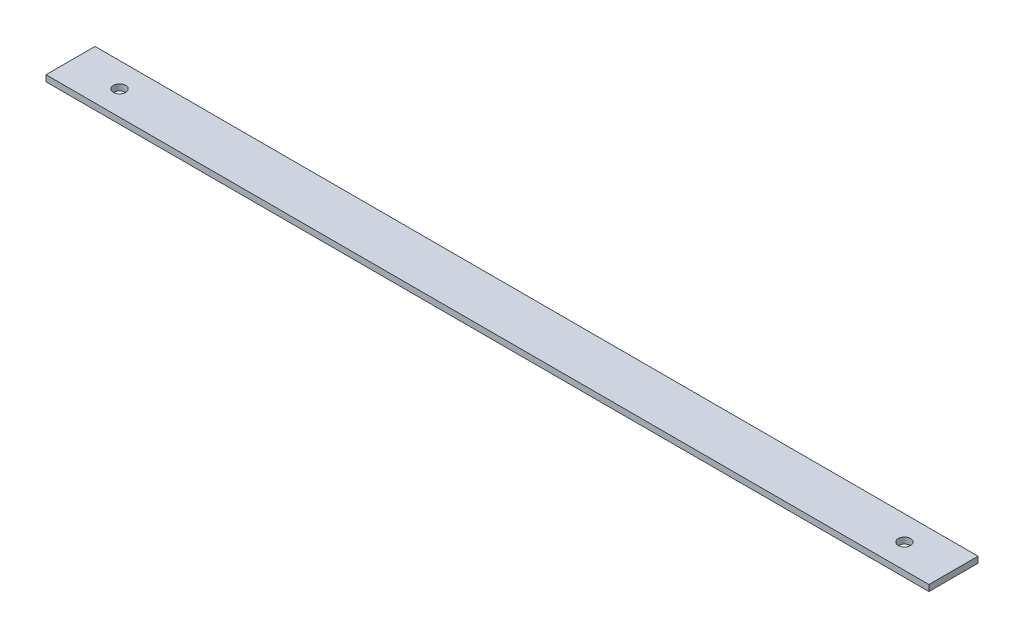
ISO-10303-21;
HEADER;
FILE_DESCRIPTION(('STEP AP214'),'2;1');
FILE_NAME('part.step','',(''),(''),'','','');
FILE_SCHEMA(('AUTOMOTIVE_DESIGN { 1 0 10303 214 1 1 1 1 }'));
ENDSEC;
DATA;
#1=APPLICATION_CONTEXT('core data for automotive mechanical design processes');
#2=APPLICATION_PROTOCOL_DEFINITION('international standard','automotive_design',2000,#1);
#3=PRODUCT_CONTEXT('',#1,'mechanical');
#4=PRODUCT('Part','Part','',(#3));
#5=PRODUCT_RELATED_PRODUCT_CATEGORY('part','',(#4));
#6=PRODUCT_DEFINITION_FORMATION('','',#4);
#7=PRODUCT_DEFINITION_CONTEXT('part definition',#1,'design');
#8=PRODUCT_DEFINITION('design','',#6,#7);
#9=PRODUCT_DEFINITION_SHAPE('','',#8);
#10=(LENGTH_UNIT() NAMED_UNIT(*) SI_UNIT(.MILLI.,.METRE.));
#11=(NAMED_UNIT(*) PLANE_ANGLE_UNIT() SI_UNIT($,.RADIAN.));
#12=(NAMED_UNIT(*) SI_UNIT($,.STERADIAN.) SOLID_ANGLE_UNIT());
#13=UNCERTAINTY_MEASURE_WITH_UNIT(LENGTH_MEASURE(1.E-05),#10,'distance_accuracy_value','');
#14=(GEOMETRIC_REPRESENTATION_CONTEXT(3) GLOBAL_UNCERTAINTY_ASSIGNED_CONTEXT((#13)) GLOBAL_UNIT_ASSIGNED_CONTEXT((#10,
#11,#12)) REPRESENTATION_CONTEXT('',''));
#15=CARTESIAN_POINT('',(0.,0.,0.));
#16=DIRECTION('',(0.,0.,1.));
#17=DIRECTION('',(1.,0.,0.));
#18=AXIS2_PLACEMENT_3D('',#15,#16,#17);
#19=CARTESIAN_POINT('',(0.,3.175,0.));
#20=DIRECTION('',(1.,0.,0.));
#21=DIRECTION('',(0.,0.,-1.));
#22=AXIS2_PLACEMENT_3D('',#19,#20,#21);
#23=PLANE('',#22);
#24=DIRECTION('',(0.,0.,1.));
#25=VECTOR('',#24,1.);
#26=CARTESIAN_POINT('',(0.,0.,0.));
#27=LINE('',#26,#25);
#28=CARTESIAN_POINT('',(0.,0.,-25.4));
#29=VERTEX_POINT('',#28);
#30=CARTESIAN_POINT('',(0.,0.,0.));
#31=VERTEX_POINT('',#30);
#32=EDGE_CURVE('E116',#29,#31,#27,.T.);
#33=ORIENTED_EDGE('',*,*,#32,.T.);
#34=DIRECTION('',(0.,-1.,0.));
#35=VECTOR('',#34,1.);
#36=CARTESIAN_POINT('',(0.,3.175,0.));
#37=LINE('',#36,#35);
#38=CARTESIAN_POINT('',(0.,3.175,0.));
#39=VERTEX_POINT('',#38);
#40=EDGE_CURVE('E11',#39,#31,#37,.T.);
#41=ORIENTED_EDGE('',*,*,#40,.F.);
#42=DIRECTION('',(0.,0.,1.));
#43=VECTOR('',#42,1.);
#44=CARTESIAN_POINT('',(0.,3.175,0.));
#45=LINE('',#44,#43);
#46=CARTESIAN_POINT('',(0.,3.175,-25.4));
#47=VERTEX_POINT('',#46);
#48=EDGE_CURVE('E99',#47,#39,#45,.T.);
#49=ORIENTED_EDGE('',*,*,#48,.F.);
#50=DIRECTION('',(0.,-1.,0.));
#51=VECTOR('',#50,1.);
#52=CARTESIAN_POINT('',(0.,3.175,-25.4));
#53=LINE('',#52,#51);
#54=EDGE_CURVE('E112',#47,#29,#53,.T.);
#55=ORIENTED_EDGE('',*,*,#54,.T.);
#56=EDGE_LOOP('',(#33,#41,#49,#55));
#57=FACE_BOUND('',#56,.T.);
#58=ADVANCED_FACE('F39',(#57),#23,.F.);
#59=CARTESIAN_POINT('',(0.,3.175,0.));
#60=DIRECTION('',(0.,0.,-1.));
#61=DIRECTION('',(-1.,0.,0.));
#62=AXIS2_PLACEMENT_3D('',#59,#60,#61);
#63=PLANE('',#62);
#64=DIRECTION('',(1.,0.,0.));
#65=VECTOR('',#64,1.);
#66=CARTESIAN_POINT('',(0.,0.,0.));
#67=LINE('',#66,#65);
#68=CARTESIAN_POINT('',(457.2,0.,0.));
#69=VERTEX_POINT('',#68);
#70=EDGE_CURVE('E104',#31,#69,#67,.T.);
#71=ORIENTED_EDGE('',*,*,#70,.T.);
#72=DIRECTION('',(0.,-1.,0.));
#73=VECTOR('',#72,1.);
#74=CARTESIAN_POINT('',(457.2,3.175,0.));
#75=LINE('',#74,#73);
#76=CARTESIAN_POINT('',(457.2,3.175,0.));
#77=VERTEX_POINT('',#76);
#78=EDGE_CURVE('E48',#77,#69,#75,.T.);
#79=ORIENTED_EDGE('',*,*,#78,.F.);
#80=DIRECTION('',(1.,0.,0.));
#81=VECTOR('',#80,1.);
#82=CARTESIAN_POINT('',(0.,3.175,0.));
#83=LINE('',#82,#81);
#84=EDGE_CURVE('E94',#39,#77,#83,.T.);
#85=ORIENTED_EDGE('',*,*,#84,.F.);
#86=ORIENTED_EDGE('',*,*,#40,.T.);
#87=EDGE_LOOP('',(#71,#79,#85,#86));
#88=FACE_BOUND('',#87,.T.);
#89=ADVANCED_FACE('F103',(#88),#63,.F.);
#90=CARTESIAN_POINT('',(457.2,3.175,0.));
#91=DIRECTION('',(-1.,0.,0.));
#92=DIRECTION('',(0.,0.,1.));
#93=AXIS2_PLACEMENT_3D('',#90,#91,#92);
#94=PLANE('',#93);
#95=DIRECTION('',(0.,0.,-1.));
#96=VECTOR('',#95,1.);
#97=CARTESIAN_POINT('',(457.2,0.,0.));
#98=LINE('',#97,#96);
#99=CARTESIAN_POINT('',(457.2,0.,-25.4));
#100=VERTEX_POINT('',#99);
#101=EDGE_CURVE('E80',#69,#100,#98,.T.);
#102=ORIENTED_EDGE('',*,*,#101,.T.);
#103=DIRECTION('',(0.,-1.,0.));
#104=VECTOR('',#103,1.);
#105=CARTESIAN_POINT('',(457.2,3.175,-25.4));
#106=LINE('',#105,#104);
#107=CARTESIAN_POINT('',(457.2,3.175,-25.4));
#108=VERTEX_POINT('',#107);
#109=EDGE_CURVE('E106',#108,#100,#106,.T.);
#110=ORIENTED_EDGE('',*,*,#109,.F.);
#111=DIRECTION('',(0.,0.,-1.));
#112=VECTOR('',#111,1.);
#113=CARTESIAN_POINT('',(457.2,3.175,0.));
#114=LINE('',#113,#112);
#115=EDGE_CURVE('E97',#77,#108,#114,.T.);
#116=ORIENTED_EDGE('',*,*,#115,.F.);
#117=ORIENTED_EDGE('',*,*,#78,.T.);
#118=EDGE_LOOP('',(#102,#110,#116,#117));
#119=FACE_BOUND('',#118,.T.);
#120=ADVANCED_FACE('F107',(#119),#94,.F.);
#121=CARTESIAN_POINT('',(0.,3.175,-25.4));
#122=DIRECTION('',(0.,0.,1.));
#123=DIRECTION('',(1.,0.,0.));
#124=AXIS2_PLACEMENT_3D('',#121,#122,#123);
#125=PLANE('',#124);
#126=DIRECTION('',(-1.,0.,0.));
#127=VECTOR('',#126,1.);
#128=CARTESIAN_POINT('',(0.,0.,-25.4));
#129=LINE('',#128,#127);
#130=EDGE_CURVE('E87',#100,#29,#129,.T.);
#131=ORIENTED_EDGE('',*,*,#130,.T.);
#132=ORIENTED_EDGE('',*,*,#54,.F.);
#133=DIRECTION('',(-1.,0.,0.));
#134=VECTOR('',#133,1.);
#135=CARTESIAN_POINT('',(0.,3.175,-25.4));
#136=LINE('',#135,#134);
#137=EDGE_CURVE('E58',#108,#47,#136,.T.);
#138=ORIENTED_EDGE('',*,*,#137,.F.);
#139=ORIENTED_EDGE('',*,*,#109,.T.);
#140=EDGE_LOOP('',(#131,#132,#138,#139));
#141=FACE_BOUND('',#140,.T.);
#142=ADVANCED_FACE('F130',(#141),#125,.F.);
#143=CARTESIAN_POINT('',(0.,3.175,0.));
#144=DIRECTION('',(0.,-1.,0.));
#145=DIRECTION('',(0.,0.,-1.));
#146=AXIS2_PLACEMENT_3D('',#143,#144,#145);
#147=PLANE('',#146);
#148=CARTESIAN_POINT('',(431.8,3.175,-12.7));
#149=DIRECTION('',(0.,1.,0.));
#150=DIRECTION('',(0.,0.,1.));
#151=AXIS2_PLACEMENT_3D('',#148,#149,#150);
#152=CIRCLE('',#151,3.17499999999997);
#153=CARTESIAN_POINT('',(431.8,3.175,-9.52500000000003));
#154=VERTEX_POINT('',#153);
#155=EDGE_CURVE('E144',#154,#154,#152,.T.);
#156=ORIENTED_EDGE('',*,*,#155,.F.);
#157=EDGE_LOOP('',(#156));
#158=FACE_BOUND('',#157,.T.);
#159=CARTESIAN_POINT('',(25.4,3.175,-12.7));
#160=DIRECTION('',(0.,1.,0.));
#161=DIRECTION('',(0.,0.,1.));
#162=AXIS2_PLACEMENT_3D('',#159,#160,#161);
#163=CIRCLE('',#162,3.175);
#164=CARTESIAN_POINT('',(25.4,3.175,-9.525));
#165=VERTEX_POINT('',#164);
#166=EDGE_CURVE('E137',#165,#165,#163,.T.);
#167=ORIENTED_EDGE('',*,*,#166,.F.);
#168=EDGE_LOOP('',(#167));
#169=FACE_BOUND('',#168,.T.);
#170=ORIENTED_EDGE('',*,*,#48,.T.);
#171=ORIENTED_EDGE('',*,*,#84,.T.);
#172=ORIENTED_EDGE('',*,*,#115,.T.);
#173=ORIENTED_EDGE('',*,*,#137,.T.);
#174=EDGE_LOOP('',(#170,#171,#172,#173));
#175=FACE_BOUND('',#174,.T.);
#176=ADVANCED_FACE('F95',(#158,#169,#175),#147,.F.);
#177=CARTESIAN_POINT('',(0.,0.,0.));
#178=DIRECTION('',(0.,-1.,0.));
#179=DIRECTION('',(0.,0.,-1.));
#180=AXIS2_PLACEMENT_3D('',#177,#178,#179);
#181=PLANE('',#180);
#182=CARTESIAN_POINT('',(431.8,0.,-12.7));
#183=DIRECTION('',(0.,1.,0.));
#184=DIRECTION('',(0.,0.,1.));
#185=AXIS2_PLACEMENT_3D('',#182,#183,#184);
#186=CIRCLE('',#185,3.17499999999997);
#187=CARTESIAN_POINT('',(431.8,0.,-9.52500000000003));
#188=VERTEX_POINT('',#187);
#189=EDGE_CURVE('E120',#188,#188,#186,.T.);
#190=ORIENTED_EDGE('',*,*,#189,.T.);
#191=EDGE_LOOP('',(#190));
#192=FACE_BOUND('',#191,.T.);
#193=CARTESIAN_POINT('',(25.4,0.,-12.7));
#194=DIRECTION('',(0.,1.,0.));
#195=DIRECTION('',(0.,0.,1.));
#196=AXIS2_PLACEMENT_3D('',#193,#194,#195);
#197=CIRCLE('',#196,3.175);
#198=CARTESIAN_POINT('',(25.4,0.,-9.525));
#199=VERTEX_POINT('',#198);
#200=EDGE_CURVE('E141',#199,#199,#197,.T.);
#201=ORIENTED_EDGE('',*,*,#200,.T.);
#202=EDGE_LOOP('',(#201));
#203=FACE_BOUND('',#202,.T.);
#204=ORIENTED_EDGE('',*,*,#32,.F.);
#205=ORIENTED_EDGE('',*,*,#130,.F.);
#206=ORIENTED_EDGE('',*,*,#101,.F.);
#207=ORIENTED_EDGE('',*,*,#70,.F.);
#208=EDGE_LOOP('',(#204,#205,#206,#207));
#209=FACE_BOUND('',#208,.T.);
#210=ADVANCED_FACE('F133',(#192,#203,#209),#181,.T.);
#211=CARTESIAN_POINT('',(25.4,0.,-12.7));
#212=DIRECTION('',(0.,1.,0.));
#213=DIRECTION('',(0.,0.,1.));
#214=AXIS2_PLACEMENT_3D('',#211,#212,#213);
#215=CYLINDRICAL_SURFACE('',#214,3.175);
#216=ORIENTED_EDGE('',*,*,#200,.F.);
#217=EDGE_LOOP('',(#216));
#218=FACE_BOUND('',#217,.T.);
#219=ORIENTED_EDGE('',*,*,#166,.T.);
#220=EDGE_LOOP('',(#219));
#221=FACE_BOUND('',#220,.T.);
#222=ADVANCED_FACE('F157',(#218,#221),#215,.F.);
#223=CARTESIAN_POINT('',(431.8,0.,-12.7));
#224=DIRECTION('',(0.,1.,0.));
#225=DIRECTION('',(0.,0.,1.));
#226=AXIS2_PLACEMENT_3D('',#223,#224,#225);
#227=CYLINDRICAL_SURFACE('',#226,3.17499999999997);
#228=ORIENTED_EDGE('',*,*,#189,.F.);
#229=EDGE_LOOP('',(#228));
#230=FACE_BOUND('',#229,.T.);
#231=ORIENTED_EDGE('',*,*,#155,.T.);
#232=EDGE_LOOP('',(#231));
#233=FACE_BOUND('',#232,.T.);
#234=ADVANCED_FACE('F154',(#230,#233),#227,.F.);
#235=CLOSED_SHELL('',(#58,#89,#120,#142,#176,#210,#222,#234));
#236=MANIFOLD_SOLID_BREP('B2',#235);
#237=ADVANCED_BREP_SHAPE_REPRESENTATION('',(#18,#236),#14);
#238=SHAPE_DEFINITION_REPRESENTATION(#9,#237);
ENDSEC;
END-ISO-10303-21;
